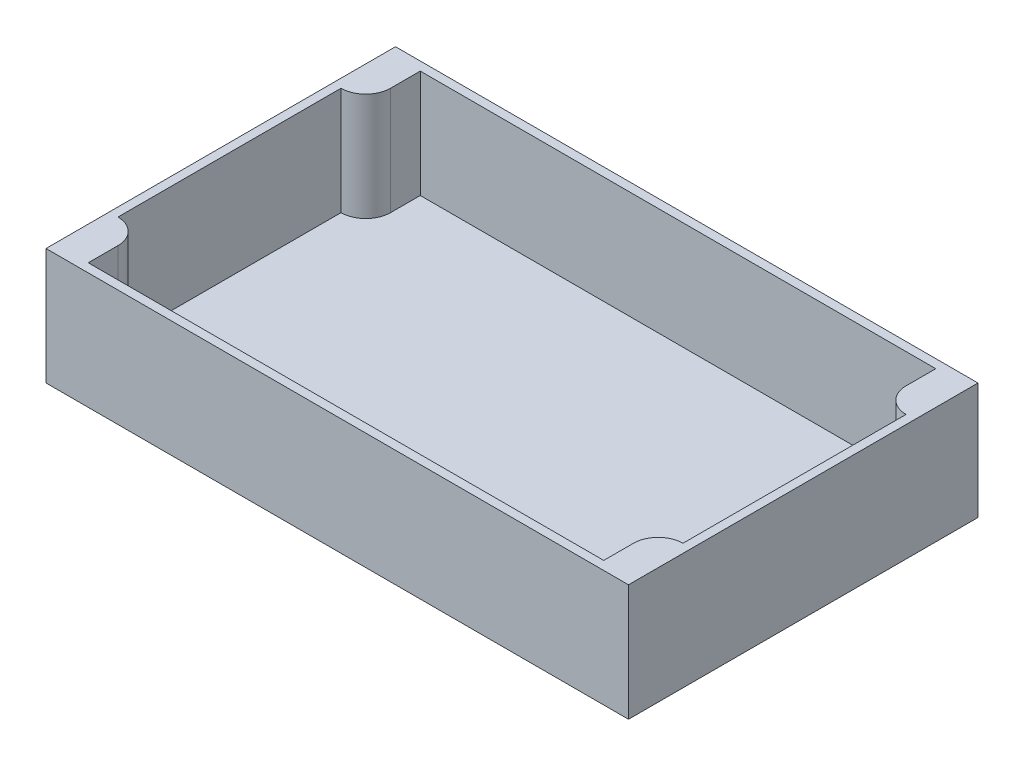
ISO-10303-21;
HEADER;
FILE_DESCRIPTION(('STEP AP214'),'2;1');
FILE_NAME('part.step','',(''),(''),'','','');
FILE_SCHEMA(('AUTOMOTIVE_DESIGN { 1 0 10303 214 1 1 1 1 }'));
ENDSEC;
DATA;
#1=APPLICATION_CONTEXT('core data for automotive mechanical design processes');
#2=APPLICATION_PROTOCOL_DEFINITION('international standard','automotive_design',2000,#1);
#3=PRODUCT_CONTEXT('',#1,'mechanical');
#4=PRODUCT('Part','Part','',(#3));
#5=PRODUCT_RELATED_PRODUCT_CATEGORY('part','',(#4));
#6=PRODUCT_DEFINITION_FORMATION('','',#4);
#7=PRODUCT_DEFINITION_CONTEXT('part definition',#1,'design');
#8=PRODUCT_DEFINITION('design','',#6,#7);
#9=PRODUCT_DEFINITION_SHAPE('','',#8);
#10=(LENGTH_UNIT() NAMED_UNIT(*) SI_UNIT(.MILLI.,.METRE.));
#11=(NAMED_UNIT(*) PLANE_ANGLE_UNIT() SI_UNIT($,.RADIAN.));
#12=(NAMED_UNIT(*) SI_UNIT($,.STERADIAN.) SOLID_ANGLE_UNIT());
#13=UNCERTAINTY_MEASURE_WITH_UNIT(LENGTH_MEASURE(1.E-05),#10,'distance_accuracy_value','');
#14=(GEOMETRIC_REPRESENTATION_CONTEXT(3) GLOBAL_UNCERTAINTY_ASSIGNED_CONTEXT((#13)) GLOBAL_UNIT_ASSIGNED_CONTEXT((#10,
#11,#12)) REPRESENTATION_CONTEXT('',''));
#15=CARTESIAN_POINT('',(0.,0.,0.));
#16=DIRECTION('',(0.,0.,1.));
#17=DIRECTION('',(1.,0.,0.));
#18=AXIS2_PLACEMENT_3D('',#15,#16,#17);
#19=CARTESIAN_POINT('',(0.,3.,0.));
#20=DIRECTION('',(1.,0.,0.));
#21=DIRECTION('',(0.,0.,-1.));
#22=AXIS2_PLACEMENT_3D('',#19,#20,#21);
#23=PLANE('',#22);
#24=DIRECTION('',(0.,0.,1.));
#25=VECTOR('',#24,1.);
#26=CARTESIAN_POINT('',(0.,0.,0.));
#27=LINE('',#26,#25);
#28=CARTESIAN_POINT('',(0.,0.,-120.));
#29=VERTEX_POINT('',#28);
#30=CARTESIAN_POINT('',(0.,0.,0.));
#31=VERTEX_POINT('',#30);
#32=EDGE_CURVE('E183',#29,#31,#27,.T.);
#33=ORIENTED_EDGE('',*,*,#32,.T.);
#34=DIRECTION('',(0.,-1.,0.));
#35=VECTOR('',#34,1.);
#36=CARTESIAN_POINT('',(0.,3.,0.));
#37=LINE('',#36,#35);
#38=CARTESIAN_POINT('',(0.,40.,0.));
#39=VERTEX_POINT('',#38);
#40=EDGE_CURVE('E12',#39,#31,#37,.T.);
#41=ORIENTED_EDGE('',*,*,#40,.F.);
#42=DIRECTION('',(0.,0.,-1.));
#43=VECTOR('',#42,1.);
#44=CARTESIAN_POINT('',(0.,40.,0.));
#45=LINE('',#44,#43);
#46=CARTESIAN_POINT('',(0.,40.,-120.));
#47=VERTEX_POINT('',#46);
#48=EDGE_CURVE('E171',#39,#47,#45,.T.);
#49=ORIENTED_EDGE('',*,*,#48,.T.);
#50=DIRECTION('',(0.,-1.,0.));
#51=VECTOR('',#50,1.);
#52=CARTESIAN_POINT('',(0.,3.,-120.));
#53=LINE('',#52,#51);
#54=EDGE_CURVE('E158',#47,#29,#53,.T.);
#55=ORIENTED_EDGE('',*,*,#54,.T.);
#56=EDGE_LOOP('',(#33,#41,#49,#55));
#57=FACE_BOUND('',#56,.T.);
#58=ADVANCED_FACE('F37',(#57),#23,.F.);
#59=CARTESIAN_POINT('',(0.,3.,0.));
#60=DIRECTION('',(0.,0.,-1.));
#61=DIRECTION('',(-1.,0.,0.));
#62=AXIS2_PLACEMENT_3D('',#59,#60,#61);
#63=PLANE('',#62);
#64=DIRECTION('',(1.,0.,0.));
#65=VECTOR('',#64,1.);
#66=CARTESIAN_POINT('',(0.,0.,0.));
#67=LINE('',#66,#65);
#68=CARTESIAN_POINT('',(200.,0.,0.));
#69=VERTEX_POINT('',#68);
#70=EDGE_CURVE('E204',#31,#69,#67,.T.);
#71=ORIENTED_EDGE('',*,*,#70,.T.);
#72=DIRECTION('',(0.,-1.,0.));
#73=VECTOR('',#72,1.);
#74=CARTESIAN_POINT('',(200.,3.,0.));
#75=LINE('',#74,#73);
#76=CARTESIAN_POINT('',(200.,40.,0.));
#77=VERTEX_POINT('',#76);
#78=EDGE_CURVE('E44',#77,#69,#75,.T.);
#79=ORIENTED_EDGE('',*,*,#78,.F.);
#80=DIRECTION('',(-1.,0.,0.));
#81=VECTOR('',#80,1.);
#82=CARTESIAN_POINT('',(200.,40.,0.));
#83=LINE('',#82,#81);
#84=EDGE_CURVE('E168',#77,#39,#83,.T.);
#85=ORIENTED_EDGE('',*,*,#84,.T.);
#86=ORIENTED_EDGE('',*,*,#40,.T.);
#87=EDGE_LOOP('',(#71,#79,#85,#86));
#88=FACE_BOUND('',#87,.T.);
#89=ADVANCED_FACE('F213',(#88),#63,.F.);
#90=CARTESIAN_POINT('',(200.,3.,0.));
#91=DIRECTION('',(-1.,0.,0.));
#92=DIRECTION('',(0.,0.,1.));
#93=AXIS2_PLACEMENT_3D('',#90,#91,#92);
#94=PLANE('',#93);
#95=DIRECTION('',(0.,0.,-1.));
#96=VECTOR('',#95,1.);
#97=CARTESIAN_POINT('',(200.,0.,0.));
#98=LINE('',#97,#96);
#99=CARTESIAN_POINT('',(200.,0.,-120.));
#100=VERTEX_POINT('',#99);
#101=EDGE_CURVE('E156',#69,#100,#98,.T.);
#102=ORIENTED_EDGE('',*,*,#101,.T.);
#103=DIRECTION('',(0.,-1.,0.));
#104=VECTOR('',#103,1.);
#105=CARTESIAN_POINT('',(200.,3.,-120.));
#106=LINE('',#105,#104);
#107=CARTESIAN_POINT('',(200.,40.,-120.));
#108=VERTEX_POINT('',#107);
#109=EDGE_CURVE('E150',#108,#100,#106,.T.);
#110=ORIENTED_EDGE('',*,*,#109,.F.);
#111=DIRECTION('',(0.,0.,1.));
#112=VECTOR('',#111,1.);
#113=CARTESIAN_POINT('',(200.,40.,0.));
#114=LINE('',#113,#112);
#115=EDGE_CURVE('E154',#108,#77,#114,.T.);
#116=ORIENTED_EDGE('',*,*,#115,.T.);
#117=ORIENTED_EDGE('',*,*,#78,.T.);
#118=EDGE_LOOP('',(#102,#110,#116,#117));
#119=FACE_BOUND('',#118,.T.);
#120=ADVANCED_FACE('F152',(#119),#94,.F.);
#121=CARTESIAN_POINT('',(0.,3.,-120.));
#122=DIRECTION('',(0.,0.,1.));
#123=DIRECTION('',(1.,0.,0.));
#124=AXIS2_PLACEMENT_3D('',#121,#122,#123);
#125=PLANE('',#124);
#126=DIRECTION('',(-1.,0.,0.));
#127=VECTOR('',#126,1.);
#128=CARTESIAN_POINT('',(0.,0.,-120.));
#129=LINE('',#128,#127);
#130=EDGE_CURVE('E59',#100,#29,#129,.T.);
#131=ORIENTED_EDGE('',*,*,#130,.T.);
#132=ORIENTED_EDGE('',*,*,#54,.F.);
#133=DIRECTION('',(1.,0.,0.));
#134=VECTOR('',#133,1.);
#135=CARTESIAN_POINT('',(200.,40.,-120.));
#136=LINE('',#135,#134);
#137=EDGE_CURVE('E165',#47,#108,#136,.T.);
#138=ORIENTED_EDGE('',*,*,#137,.T.);
#139=ORIENTED_EDGE('',*,*,#109,.T.);
#140=EDGE_LOOP('',(#131,#132,#138,#139));
#141=FACE_BOUND('',#140,.T.);
#142=ADVANCED_FACE('F170',(#141),#125,.F.);
#143=CARTESIAN_POINT('',(0.,0.,0.));
#144=DIRECTION('',(0.,-1.,0.));
#145=DIRECTION('',(0.,0.,-1.));
#146=AXIS2_PLACEMENT_3D('',#143,#144,#145);
#147=PLANE('',#146);
#148=ORIENTED_EDGE('',*,*,#32,.F.);
#149=ORIENTED_EDGE('',*,*,#130,.F.);
#150=ORIENTED_EDGE('',*,*,#101,.F.);
#151=ORIENTED_EDGE('',*,*,#70,.F.);
#152=EDGE_LOOP('',(#148,#149,#150,#151));
#153=FACE_BOUND('',#152,.T.);
#154=ADVANCED_FACE('F211',(#153),#147,.T.);
#155=CARTESIAN_POINT('',(3.00000000000001,313.238075793812,-13.2));
#156=DIRECTION('',(0.,-1.,0.));
#157=DIRECTION('',(0.,0.,-1.));
#158=AXIS2_PLACEMENT_3D('',#155,#156,#157);
#159=CYLINDRICAL_SURFACE('',#158,8.5);
#160=CARTESIAN_POINT('',(3.00000000000001,40.,-13.2));
#161=DIRECTION('',(0.,-1.,0.));
#162=DIRECTION('',(0.,0.,-1.));
#163=AXIS2_PLACEMENT_3D('',#160,#161,#162);
#164=CIRCLE('',#163,8.5);
#165=CARTESIAN_POINT('',(11.5,40.,-13.2));
#166=VERTEX_POINT('',#165);
#167=CARTESIAN_POINT('',(3.,40.,-21.7));
#168=VERTEX_POINT('',#167);
#169=EDGE_CURVE('E177',#166,#168,#164,.F.);
#170=ORIENTED_EDGE('',*,*,#169,.F.);
#171=DIRECTION('',(0.,-1.,0.));
#172=VECTOR('',#171,1.);
#173=CARTESIAN_POINT('',(11.5,313.238075793812,-13.2));
#174=LINE('',#173,#172);
#175=CARTESIAN_POINT('',(11.5,3.,-13.2));
#176=VERTEX_POINT('',#175);
#177=EDGE_CURVE('E173',#166,#176,#174,.T.);
#178=ORIENTED_EDGE('',*,*,#177,.T.);
#179=CARTESIAN_POINT('',(3.00000000000001,3.,-13.2));
#180=DIRECTION('',(0.,-1.,0.));
#181=DIRECTION('',(0.,0.,-1.));
#182=AXIS2_PLACEMENT_3D('',#179,#180,#181);
#183=CIRCLE('',#182,8.5);
#184=CARTESIAN_POINT('',(3.,3.,-21.7));
#185=VERTEX_POINT('',#184);
#186=EDGE_CURVE('E51',#185,#176,#183,.T.);
#187=ORIENTED_EDGE('',*,*,#186,.F.);
#188=DIRECTION('',(0.,-1.,0.));
#189=VECTOR('',#188,1.);
#190=CARTESIAN_POINT('',(3.,313.238075793812,-21.7));
#191=LINE('',#190,#189);
#192=EDGE_CURVE('E180',#168,#185,#191,.T.);
#193=ORIENTED_EDGE('',*,*,#192,.F.);
#194=EDGE_LOOP('',(#170,#178,#187,#193));
#195=FACE_BOUND('',#194,.T.);
#196=ADVANCED_FACE('F280',(#195),#159,.T.);
#197=CARTESIAN_POINT('',(11.5,313.238075793812,-13.2));
#198=DIRECTION('',(1.,0.,0.));
#199=DIRECTION('',(0.,0.,-1.));
#200=AXIS2_PLACEMENT_3D('',#197,#198,#199);
#201=PLANE('',#200);
#202=DIRECTION('',(0.,0.,-1.));
#203=VECTOR('',#202,1.);
#204=CARTESIAN_POINT('',(11.5,40.,-13.2));
#205=LINE('',#204,#203);
#206=CARTESIAN_POINT('',(11.5,40.,-3.00000000000001));
#207=VERTEX_POINT('',#206);
#208=EDGE_CURVE('E181',#207,#166,#205,.T.);
#209=ORIENTED_EDGE('',*,*,#208,.F.);
#210=DIRECTION('',(0.,-1.,0.));
#211=VECTOR('',#210,1.);
#212=CARTESIAN_POINT('',(11.5,313.238075793812,-3.00000000000001));
#213=LINE('',#212,#211);
#214=CARTESIAN_POINT('',(11.5,3.,-3.00000000000001));
#215=VERTEX_POINT('',#214);
#216=EDGE_CURVE('E238',#207,#215,#213,.T.);
#217=ORIENTED_EDGE('',*,*,#216,.T.);
#218=DIRECTION('',(0.,0.,1.));
#219=VECTOR('',#218,1.);
#220=CARTESIAN_POINT('',(11.5,3.,-13.2));
#221=LINE('',#220,#219);
#222=EDGE_CURVE('E243',#176,#215,#221,.T.);
#223=ORIENTED_EDGE('',*,*,#222,.F.);
#224=ORIENTED_EDGE('',*,*,#177,.F.);
#225=EDGE_LOOP('',(#209,#217,#223,#224));
#226=FACE_BOUND('',#225,.T.);
#227=ADVANCED_FACE('F286',(#226),#201,.T.);
#228=CARTESIAN_POINT('',(11.5,313.238075793812,-3.00000000000001));
#229=DIRECTION('',(0.,0.,-1.));
#230=DIRECTION('',(-1.,0.,0.));
#231=AXIS2_PLACEMENT_3D('',#228,#229,#230);
#232=PLANE('',#231);
#233=DIRECTION('',(-1.,0.,0.));
#234=VECTOR('',#233,1.);
#235=CARTESIAN_POINT('',(11.5,40.,-3.00000000000001));
#236=LINE('',#235,#234);
#237=CARTESIAN_POINT('',(188.5,40.,-3.00000000000001));
#238=VERTEX_POINT('',#237);
#239=EDGE_CURVE('E184',#238,#207,#236,.T.);
#240=ORIENTED_EDGE('',*,*,#239,.F.);
#241=DIRECTION('',(0.,-1.,0.));
#242=VECTOR('',#241,1.);
#243=CARTESIAN_POINT('',(188.5,313.238075793812,-3.00000000000001));
#244=LINE('',#243,#242);
#245=CARTESIAN_POINT('',(188.5,3.,-3.00000000000001));
#246=VERTEX_POINT('',#245);
#247=EDGE_CURVE('E236',#238,#246,#244,.T.);
#248=ORIENTED_EDGE('',*,*,#247,.T.);
#249=DIRECTION('',(1.,0.,0.));
#250=VECTOR('',#249,1.);
#251=CARTESIAN_POINT('',(11.5,3.,-3.00000000000001));
#252=LINE('',#251,#250);
#253=EDGE_CURVE('E247',#215,#246,#252,.T.);
#254=ORIENTED_EDGE('',*,*,#253,.F.);
#255=ORIENTED_EDGE('',*,*,#216,.F.);
#256=EDGE_LOOP('',(#240,#248,#254,#255));
#257=FACE_BOUND('',#256,.T.);
#258=ADVANCED_FACE('F292',(#257),#232,.T.);
#259=CARTESIAN_POINT('',(188.5,313.238075793812,-13.2));
#260=DIRECTION('',(-1.,0.,0.));
#261=DIRECTION('',(0.,0.,1.));
#262=AXIS2_PLACEMENT_3D('',#259,#260,#261);
#263=PLANE('',#262);
#264=DIRECTION('',(0.,0.,1.));
#265=VECTOR('',#264,1.);
#266=CARTESIAN_POINT('',(188.5,40.,-13.2));
#267=LINE('',#266,#265);
#268=CARTESIAN_POINT('',(188.5,40.,-13.2));
#269=VERTEX_POINT('',#268);
#270=EDGE_CURVE('E186',#269,#238,#267,.T.);
#271=ORIENTED_EDGE('',*,*,#270,.F.);
#272=DIRECTION('',(0.,-1.,0.));
#273=VECTOR('',#272,1.);
#274=CARTESIAN_POINT('',(188.5,313.238075793812,-13.2));
#275=LINE('',#274,#273);
#276=CARTESIAN_POINT('',(188.5,3.,-13.2));
#277=VERTEX_POINT('',#276);
#278=EDGE_CURVE('E234',#269,#277,#275,.T.);
#279=ORIENTED_EDGE('',*,*,#278,.T.);
#280=DIRECTION('',(0.,0.,-1.));
#281=VECTOR('',#280,1.);
#282=CARTESIAN_POINT('',(188.5,3.,-13.2));
#283=LINE('',#282,#281);
#284=EDGE_CURVE('E250',#246,#277,#283,.T.);
#285=ORIENTED_EDGE('',*,*,#284,.F.);
#286=ORIENTED_EDGE('',*,*,#247,.F.);
#287=EDGE_LOOP('',(#271,#279,#285,#286));
#288=FACE_BOUND('',#287,.T.);
#289=ADVANCED_FACE('F296',(#288),#263,.T.);
#290=CARTESIAN_POINT('',(197.,313.238075793812,-13.2));
#291=DIRECTION('',(0.,-1.,0.));
#292=DIRECTION('',(0.,0.,-1.));
#293=AXIS2_PLACEMENT_3D('',#290,#291,#292);
#294=CYLINDRICAL_SURFACE('',#293,8.5);
#295=CARTESIAN_POINT('',(197.,40.,-13.2));
#296=DIRECTION('',(0.,-1.,0.));
#297=DIRECTION('',(0.,0.,-1.));
#298=AXIS2_PLACEMENT_3D('',#295,#296,#297);
#299=CIRCLE('',#298,8.5);
#300=CARTESIAN_POINT('',(197.,40.,-21.7));
#301=VERTEX_POINT('',#300);
#302=EDGE_CURVE('E188',#301,#269,#299,.F.);
#303=ORIENTED_EDGE('',*,*,#302,.F.);
#304=DIRECTION('',(0.,-1.,0.));
#305=VECTOR('',#304,1.);
#306=CARTESIAN_POINT('',(197.,313.238075793812,-21.7));
#307=LINE('',#306,#305);
#308=CARTESIAN_POINT('',(197.,3.,-21.7));
#309=VERTEX_POINT('',#308);
#310=EDGE_CURVE('E232',#301,#309,#307,.T.);
#311=ORIENTED_EDGE('',*,*,#310,.T.);
#312=CARTESIAN_POINT('',(197.,3.,-13.2));
#313=DIRECTION('',(0.,-1.,0.));
#314=DIRECTION('',(0.,0.,1.));
#315=AXIS2_PLACEMENT_3D('',#312,#313,#314);
#316=CIRCLE('',#315,8.5);
#317=EDGE_CURVE('E253',#277,#309,#316,.T.);
#318=ORIENTED_EDGE('',*,*,#317,.F.);
#319=ORIENTED_EDGE('',*,*,#278,.F.);
#320=EDGE_LOOP('',(#303,#311,#318,#319));
#321=FACE_BOUND('',#320,.T.);
#322=ADVANCED_FACE('F301',(#321),#294,.T.);
#323=CARTESIAN_POINT('',(197.,313.238075793812,-98.3));
#324=DIRECTION('',(-1.,0.,0.));
#325=DIRECTION('',(0.,0.,1.));
#326=AXIS2_PLACEMENT_3D('',#323,#324,#325);
#327=PLANE('',#326);
#328=DIRECTION('',(0.,0.,1.));
#329=VECTOR('',#328,1.);
#330=CARTESIAN_POINT('',(197.,40.,-98.3));
#331=LINE('',#330,#329);
#332=CARTESIAN_POINT('',(197.,40.,-98.3));
#333=VERTEX_POINT('',#332);
#334=EDGE_CURVE('E190',#333,#301,#331,.T.);
#335=ORIENTED_EDGE('',*,*,#334,.F.);
#336=DIRECTION('',(0.,-1.,0.));
#337=VECTOR('',#336,1.);
#338=CARTESIAN_POINT('',(197.,313.238075793812,-98.3));
#339=LINE('',#338,#337);
#340=CARTESIAN_POINT('',(197.,3.,-98.3));
#341=VERTEX_POINT('',#340);
#342=EDGE_CURVE('E230',#333,#341,#339,.T.);
#343=ORIENTED_EDGE('',*,*,#342,.T.);
#344=DIRECTION('',(0.,0.,-1.));
#345=VECTOR('',#344,1.);
#346=CARTESIAN_POINT('',(197.,3.,-98.3));
#347=LINE('',#346,#345);
#348=EDGE_CURVE('E256',#309,#341,#347,.T.);
#349=ORIENTED_EDGE('',*,*,#348,.F.);
#350=ORIENTED_EDGE('',*,*,#310,.F.);
#351=EDGE_LOOP('',(#335,#343,#349,#350));
#352=FACE_BOUND('',#351,.T.);
#353=ADVANCED_FACE('F307',(#352),#327,.T.);
#354=CARTESIAN_POINT('',(197.,313.238075793812,-106.8));
#355=DIRECTION('',(0.,-1.,0.));
#356=DIRECTION('',(0.,0.,-1.));
#357=AXIS2_PLACEMENT_3D('',#354,#355,#356);
#358=CYLINDRICAL_SURFACE('',#357,8.5);
#359=CARTESIAN_POINT('',(197.,40.,-106.8));
#360=DIRECTION('',(0.,-1.,0.));
#361=DIRECTION('',(0.,0.,-1.));
#362=AXIS2_PLACEMENT_3D('',#359,#360,#361);
#363=CIRCLE('',#362,8.5);
#364=CARTESIAN_POINT('',(188.5,40.,-106.8));
#365=VERTEX_POINT('',#364);
#366=EDGE_CURVE('E192',#365,#333,#363,.F.);
#367=ORIENTED_EDGE('',*,*,#366,.F.);
#368=DIRECTION('',(0.,-1.,0.));
#369=VECTOR('',#368,1.);
#370=CARTESIAN_POINT('',(188.5,313.238075793812,-106.8));
#371=LINE('',#370,#369);
#372=CARTESIAN_POINT('',(188.5,3.,-106.8));
#373=VERTEX_POINT('',#372);
#374=EDGE_CURVE('E228',#365,#373,#371,.T.);
#375=ORIENTED_EDGE('',*,*,#374,.T.);
#376=CARTESIAN_POINT('',(197.,3.,-106.8));
#377=DIRECTION('',(0.,-1.,0.));
#378=DIRECTION('',(0.,0.,-1.));
#379=AXIS2_PLACEMENT_3D('',#376,#377,#378);
#380=CIRCLE('',#379,8.5);
#381=EDGE_CURVE('E259',#341,#373,#380,.T.);
#382=ORIENTED_EDGE('',*,*,#381,.F.);
#383=ORIENTED_EDGE('',*,*,#342,.F.);
#384=EDGE_LOOP('',(#367,#375,#382,#383));
#385=FACE_BOUND('',#384,.T.);
#386=ADVANCED_FACE('F311',(#385),#358,.T.);
#387=CARTESIAN_POINT('',(188.5,313.238075793812,-106.8));
#388=DIRECTION('',(-1.,0.,0.));
#389=DIRECTION('',(0.,0.,1.));
#390=AXIS2_PLACEMENT_3D('',#387,#388,#389);
#391=PLANE('',#390);
#392=DIRECTION('',(0.,0.,1.));
#393=VECTOR('',#392,1.);
#394=CARTESIAN_POINT('',(188.5,40.,-106.8));
#395=LINE('',#394,#393);
#396=CARTESIAN_POINT('',(188.5,40.,-117.));
#397=VERTEX_POINT('',#396);
#398=EDGE_CURVE('E194',#397,#365,#395,.T.);
#399=ORIENTED_EDGE('',*,*,#398,.F.);
#400=DIRECTION('',(0.,-1.,0.));
#401=VECTOR('',#400,1.);
#402=CARTESIAN_POINT('',(188.5,313.238075793812,-117.));
#403=LINE('',#402,#401);
#404=CARTESIAN_POINT('',(188.5,3.,-117.));
#405=VERTEX_POINT('',#404);
#406=EDGE_CURVE('E226',#397,#405,#403,.T.);
#407=ORIENTED_EDGE('',*,*,#406,.T.);
#408=DIRECTION('',(0.,0.,-1.));
#409=VECTOR('',#408,1.);
#410=CARTESIAN_POINT('',(188.5,3.,-106.8));
#411=LINE('',#410,#409);
#412=EDGE_CURVE('E262',#373,#405,#411,.T.);
#413=ORIENTED_EDGE('',*,*,#412,.F.);
#414=ORIENTED_EDGE('',*,*,#374,.F.);
#415=EDGE_LOOP('',(#399,#407,#413,#414));
#416=FACE_BOUND('',#415,.T.);
#417=ADVANCED_FACE('F316',(#416),#391,.T.);
#418=CARTESIAN_POINT('',(11.5,313.238075793812,-117.));
#419=DIRECTION('',(0.,0.,1.));
#420=DIRECTION('',(1.,0.,0.));
#421=AXIS2_PLACEMENT_3D('',#418,#419,#420);
#422=PLANE('',#421);
#423=DIRECTION('',(1.,0.,0.));
#424=VECTOR('',#423,1.);
#425=CARTESIAN_POINT('',(11.5,40.,-117.));
#426=LINE('',#425,#424);
#427=CARTESIAN_POINT('',(11.5,40.,-117.));
#428=VERTEX_POINT('',#427);
#429=EDGE_CURVE('E196',#428,#397,#426,.T.);
#430=ORIENTED_EDGE('',*,*,#429,.F.);
#431=DIRECTION('',(0.,-1.,0.));
#432=VECTOR('',#431,1.);
#433=CARTESIAN_POINT('',(11.5,313.238075793812,-117.));
#434=LINE('',#433,#432);
#435=CARTESIAN_POINT('',(11.5,3.,-117.));
#436=VERTEX_POINT('',#435);
#437=EDGE_CURVE('E224',#428,#436,#434,.T.);
#438=ORIENTED_EDGE('',*,*,#437,.T.);
#439=DIRECTION('',(-1.,0.,0.));
#440=VECTOR('',#439,1.);
#441=CARTESIAN_POINT('',(11.5,3.,-117.));
#442=LINE('',#441,#440);
#443=EDGE_CURVE('E265',#405,#436,#442,.T.);
#444=ORIENTED_EDGE('',*,*,#443,.F.);
#445=ORIENTED_EDGE('',*,*,#406,.F.);
#446=EDGE_LOOP('',(#430,#438,#444,#445));
#447=FACE_BOUND('',#446,.T.);
#448=ADVANCED_FACE('F322',(#447),#422,.T.);
#449=CARTESIAN_POINT('',(11.5,313.238075793812,-106.8));
#450=DIRECTION('',(1.,0.,0.));
#451=DIRECTION('',(0.,0.,-1.));
#452=AXIS2_PLACEMENT_3D('',#449,#450,#451);
#453=PLANE('',#452);
#454=DIRECTION('',(0.,0.,-1.));
#455=VECTOR('',#454,1.);
#456=CARTESIAN_POINT('',(11.5,40.,-106.8));
#457=LINE('',#456,#455);
#458=CARTESIAN_POINT('',(11.5,40.,-106.8));
#459=VERTEX_POINT('',#458);
#460=EDGE_CURVE('E198',#459,#428,#457,.T.);
#461=ORIENTED_EDGE('',*,*,#460,.F.);
#462=DIRECTION('',(0.,-1.,0.));
#463=VECTOR('',#462,1.);
#464=CARTESIAN_POINT('',(11.5,313.238075793812,-106.8));
#465=LINE('',#464,#463);
#466=CARTESIAN_POINT('',(11.5,3.,-106.8));
#467=VERTEX_POINT('',#466);
#468=EDGE_CURVE('E222',#459,#467,#465,.T.);
#469=ORIENTED_EDGE('',*,*,#468,.T.);
#470=DIRECTION('',(0.,0.,1.));
#471=VECTOR('',#470,1.);
#472=CARTESIAN_POINT('',(11.5,3.,-106.8));
#473=LINE('',#472,#471);
#474=EDGE_CURVE('E216',#436,#467,#473,.T.);
#475=ORIENTED_EDGE('',*,*,#474,.F.);
#476=ORIENTED_EDGE('',*,*,#437,.F.);
#477=EDGE_LOOP('',(#461,#469,#475,#476));
#478=FACE_BOUND('',#477,.T.);
#479=ADVANCED_FACE('F326',(#478),#453,.T.);
#480=CARTESIAN_POINT('',(3.00000000000001,313.238075793812,-106.8));
#481=DIRECTION('',(0.,-1.,0.));
#482=DIRECTION('',(0.,0.,-1.));
#483=AXIS2_PLACEMENT_3D('',#480,#481,#482);
#484=CYLINDRICAL_SURFACE('',#483,8.5);
#485=CARTESIAN_POINT('',(3.00000000000001,40.,-106.8));
#486=DIRECTION('',(0.,-1.,0.));
#487=DIRECTION('',(0.,0.,-1.));
#488=AXIS2_PLACEMENT_3D('',#485,#486,#487);
#489=CIRCLE('',#488,8.5);
#490=CARTESIAN_POINT('',(3.,40.,-98.3));
#491=VERTEX_POINT('',#490);
#492=EDGE_CURVE('E200',#491,#459,#489,.F.);
#493=ORIENTED_EDGE('',*,*,#492,.F.);
#494=DIRECTION('',(0.,-1.,0.));
#495=VECTOR('',#494,1.);
#496=CARTESIAN_POINT('',(3.,313.238075793812,-98.3));
#497=LINE('',#496,#495);
#498=CARTESIAN_POINT('',(3.,3.,-98.3));
#499=VERTEX_POINT('',#498);
#500=EDGE_CURVE('E220',#491,#499,#497,.T.);
#501=ORIENTED_EDGE('',*,*,#500,.T.);
#502=CARTESIAN_POINT('',(3.00000000000001,3.,-106.8));
#503=DIRECTION('',(0.,-1.,0.));
#504=DIRECTION('',(0.,0.,1.));
#505=AXIS2_PLACEMENT_3D('',#502,#503,#504);
#506=CIRCLE('',#505,8.5);
#507=EDGE_CURVE('E214',#467,#499,#506,.T.);
#508=ORIENTED_EDGE('',*,*,#507,.F.);
#509=ORIENTED_EDGE('',*,*,#468,.F.);
#510=EDGE_LOOP('',(#493,#501,#508,#509));
#511=FACE_BOUND('',#510,.T.);
#512=ADVANCED_FACE('F330',(#511),#484,.T.);
#513=CARTESIAN_POINT('',(3.,313.238075793812,-98.3));
#514=DIRECTION('',(1.,0.,0.));
#515=DIRECTION('',(0.,0.,-1.));
#516=AXIS2_PLACEMENT_3D('',#513,#514,#515);
#517=PLANE('',#516);
#518=DIRECTION('',(0.,0.,-1.));
#519=VECTOR('',#518,1.);
#520=CARTESIAN_POINT('',(3.,40.,-98.3));
#521=LINE('',#520,#519);
#522=EDGE_CURVE('E179',#168,#491,#521,.T.);
#523=ORIENTED_EDGE('',*,*,#522,.F.);
#524=ORIENTED_EDGE('',*,*,#192,.T.);
#525=DIRECTION('',(0.,0.,1.));
#526=VECTOR('',#525,1.);
#527=CARTESIAN_POINT('',(3.,3.,-98.3));
#528=LINE('',#527,#526);
#529=EDGE_CURVE('E244',#499,#185,#528,.T.);
#530=ORIENTED_EDGE('',*,*,#529,.F.);
#531=ORIENTED_EDGE('',*,*,#500,.F.);
#532=EDGE_LOOP('',(#523,#524,#530,#531));
#533=FACE_BOUND('',#532,.T.);
#534=ADVANCED_FACE('F278',(#533),#517,.T.);
#535=CARTESIAN_POINT('',(0.,40.,0.));
#536=DIRECTION('',(0.,-1.,0.));
#537=DIRECTION('',(0.,0.,-1.));
#538=AXIS2_PLACEMENT_3D('',#535,#536,#537);
#539=PLANE('',#538);
#540=ORIENTED_EDGE('',*,*,#169,.T.);
#541=ORIENTED_EDGE('',*,*,#522,.T.);
#542=ORIENTED_EDGE('',*,*,#492,.T.);
#543=ORIENTED_EDGE('',*,*,#460,.T.);
#544=ORIENTED_EDGE('',*,*,#429,.T.);
#545=ORIENTED_EDGE('',*,*,#398,.T.);
#546=ORIENTED_EDGE('',*,*,#366,.T.);
#547=ORIENTED_EDGE('',*,*,#334,.T.);
#548=ORIENTED_EDGE('',*,*,#302,.T.);
#549=ORIENTED_EDGE('',*,*,#270,.T.);
#550=ORIENTED_EDGE('',*,*,#239,.T.);
#551=ORIENTED_EDGE('',*,*,#208,.T.);
#552=EDGE_LOOP('',(#540,#541,#542,#543,#544,#545,#546,#547,#548,#549,#550,#551));
#553=FACE_BOUND('',#552,.T.);
#554=ORIENTED_EDGE('',*,*,#115,.F.);
#555=ORIENTED_EDGE('',*,*,#137,.F.);
#556=ORIENTED_EDGE('',*,*,#48,.F.);
#557=ORIENTED_EDGE('',*,*,#84,.F.);
#558=EDGE_LOOP('',(#554,#555,#556,#557));
#559=FACE_BOUND('',#558,.T.);
#560=ADVANCED_FACE('F163',(#553,#559),#539,.F.);
#561=CARTESIAN_POINT('',(0.,3.,0.));
#562=DIRECTION('',(0.,-1.,0.));
#563=DIRECTION('',(0.,0.,-1.));
#564=AXIS2_PLACEMENT_3D('',#561,#562,#563);
#565=PLANE('',#564);
#566=ORIENTED_EDGE('',*,*,#529,.T.);
#567=ORIENTED_EDGE('',*,*,#186,.T.);
#568=ORIENTED_EDGE('',*,*,#222,.T.);
#569=ORIENTED_EDGE('',*,*,#253,.T.);
#570=ORIENTED_EDGE('',*,*,#284,.T.);
#571=ORIENTED_EDGE('',*,*,#317,.T.);
#572=ORIENTED_EDGE('',*,*,#348,.T.);
#573=ORIENTED_EDGE('',*,*,#381,.T.);
#574=ORIENTED_EDGE('',*,*,#412,.T.);
#575=ORIENTED_EDGE('',*,*,#443,.T.);
#576=ORIENTED_EDGE('',*,*,#474,.T.);
#577=ORIENTED_EDGE('',*,*,#507,.T.);
#578=EDGE_LOOP('',(#566,#567,#568,#569,#570,#571,#572,#573,#574,#575,#576,#577));
#579=FACE_BOUND('',#578,.T.);
#580=ADVANCED_FACE('F273',(#579),#565,.F.);
#581=CLOSED_SHELL('',(#58,#89,#120,#142,#154,#196,#227,#258,#289,#322,#353,#386,#417,#448,#479,
#512,#534,#560,#580));
#582=MANIFOLD_SOLID_BREP('B2',#581);
#583=ADVANCED_BREP_SHAPE_REPRESENTATION('',(#18,#582),#14);
#584=SHAPE_DEFINITION_REPRESENTATION(#9,#583);
ENDSEC;
END-ISO-10303-21;
